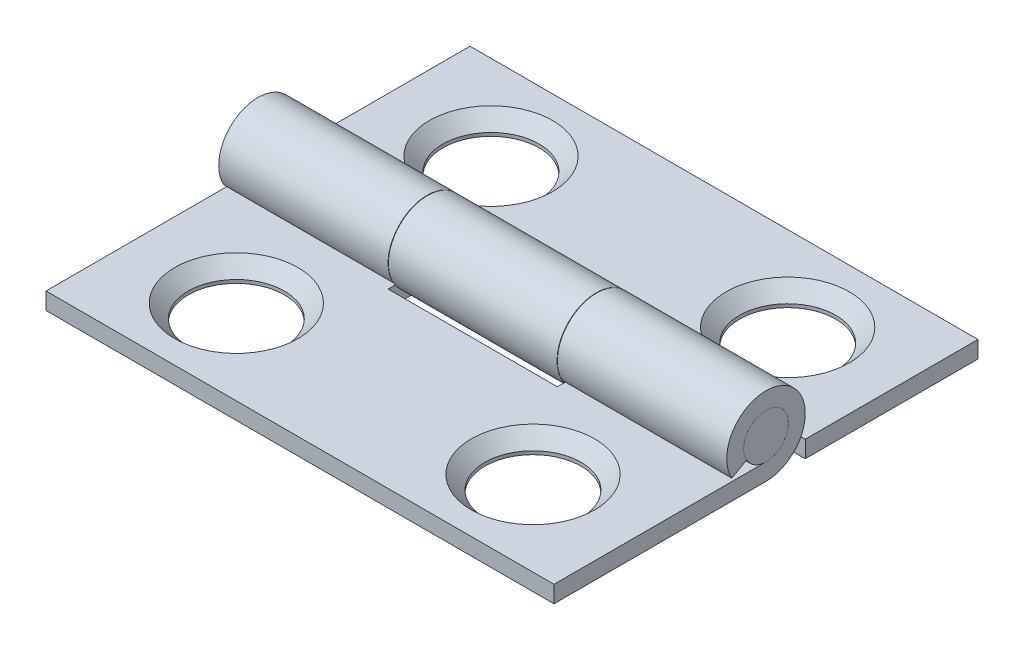
ISO-10303-21;
HEADER;
FILE_DESCRIPTION(('STEP AP214'),'2;1');
FILE_NAME('part.step','',(''),(''),'','','');
FILE_SCHEMA(('AUTOMOTIVE_DESIGN { 1 0 10303 214 1 1 1 1 }'));
ENDSEC;
DATA;
#1=APPLICATION_CONTEXT('core data for automotive mechanical design processes');
#2=APPLICATION_PROTOCOL_DEFINITION('international standard','automotive_design',2000,#1);
#3=PRODUCT_CONTEXT('',#1,'mechanical');
#4=PRODUCT('Part','Part','',(#3));
#5=PRODUCT_RELATED_PRODUCT_CATEGORY('part','',(#4));
#6=PRODUCT_DEFINITION_FORMATION('','',#4);
#7=PRODUCT_DEFINITION_CONTEXT('part definition',#1,'design');
#8=PRODUCT_DEFINITION('design','',#6,#7);
#9=PRODUCT_DEFINITION_SHAPE('','',#8);
#10=(LENGTH_UNIT() NAMED_UNIT(*) SI_UNIT(.MILLI.,.METRE.));
#11=(NAMED_UNIT(*) PLANE_ANGLE_UNIT() SI_UNIT($,.RADIAN.));
#12=(NAMED_UNIT(*) SI_UNIT($,.STERADIAN.) SOLID_ANGLE_UNIT());
#13=UNCERTAINTY_MEASURE_WITH_UNIT(LENGTH_MEASURE(1.E-05),#10,'distance_accuracy_value','');
#14=(GEOMETRIC_REPRESENTATION_CONTEXT(3) GLOBAL_UNCERTAINTY_ASSIGNED_CONTEXT((#13)) GLOBAL_UNIT_ASSIGNED_CONTEXT((#10,
#11,#12)) REPRESENTATION_CONTEXT('',''));
#15=CARTESIAN_POINT('',(0.,0.,0.));
#16=DIRECTION('',(0.,0.,1.));
#17=DIRECTION('',(1.,0.,0.));
#18=AXIS2_PLACEMENT_3D('',#15,#16,#17);
#19=CARTESIAN_POINT('',(9.525,0.,0.));
#20=DIRECTION('',(-1.,0.,0.));
#21=DIRECTION('',(0.,0.,1.));
#22=AXIS2_PLACEMENT_3D('',#19,#20,#21);
#23=CYLINDRICAL_SURFACE('',#22,0.8382);
#24=CARTESIAN_POINT('',(9.525,0.,0.));
#25=DIRECTION('',(1.,0.,0.));
#26=DIRECTION('',(0.,0.,-1.));
#27=AXIS2_PLACEMENT_3D('',#24,#25,#26);
#28=CIRCLE('',#27,0.8382);
#29=CARTESIAN_POINT('',(9.525,0.,-0.8382));
#30=VERTEX_POINT('',#29);
#31=EDGE_CURVE('E12',#30,#30,#28,.T.);
#32=ORIENTED_EDGE('',*,*,#31,.F.);
#33=EDGE_LOOP('',(#32));
#34=FACE_BOUND('',#33,.T.);
#35=CARTESIAN_POINT('',(-9.525,0.,0.));
#36=DIRECTION('',(1.,0.,0.));
#37=DIRECTION('',(0.,0.,-1.));
#38=AXIS2_PLACEMENT_3D('',#35,#36,#37);
#39=CIRCLE('',#38,0.8382);
#40=CARTESIAN_POINT('',(-9.525,0.,-0.8382));
#41=VERTEX_POINT('',#40);
#42=EDGE_CURVE('E88',#41,#41,#39,.T.);
#43=ORIENTED_EDGE('',*,*,#42,.T.);
#44=EDGE_LOOP('',(#43));
#45=FACE_BOUND('',#44,.T.);
#46=ADVANCED_FACE('F85',(#34,#45),#23,.T.);
#47=CARTESIAN_POINT('',(9.525,0.,0.));
#48=DIRECTION('',(1.,0.,0.));
#49=DIRECTION('',(0.,0.,-1.));
#50=AXIS2_PLACEMENT_3D('',#47,#48,#49);
#51=PLANE('',#50);
#52=ORIENTED_EDGE('',*,*,#31,.T.);
#53=EDGE_LOOP('',(#52));
#54=FACE_BOUND('',#53,.T.);
#55=ADVANCED_FACE('F100',(#54),#51,.T.);
#56=CARTESIAN_POINT('',(-9.525,0.,0.));
#57=DIRECTION('',(1.,0.,0.));
#58=DIRECTION('',(0.,0.,-1.));
#59=AXIS2_PLACEMENT_3D('',#56,#57,#58);
#60=PLANE('',#59);
#61=ORIENTED_EDGE('',*,*,#42,.F.);
#62=EDGE_LOOP('',(#61));
#63=FACE_BOUND('',#62,.T.);
#64=ADVANCED_FACE('F98',(#63),#60,.F.);
#65=CLOSED_SHELL('',(#46,#55,#64));
#66=MANIFOLD_SOLID_BREP('B2',#65);
#67=CARTESIAN_POINT('',(-9.525,0.,0.));
#68=DIRECTION('',(1.,0.,0.));
#69=DIRECTION('',(0.,0.,-1.));
#70=AXIS2_PLACEMENT_3D('',#67,#68,#69);
#71=CYLINDRICAL_SURFACE('',#70,1.47320000000008);
#72=DIRECTION('',(1.,0.,0.));
#73=VECTOR('',#72,1.);
#74=CARTESIAN_POINT('',(-9.525,-0.728533124002552,-1.28045215733782));
#75=LINE('',#74,#73);
#76=CARTESIAN_POINT('',(-3.1623,-0.728533124002552,-1.28045215733782));
#77=VERTEX_POINT('',#76);
#78=CARTESIAN_POINT('',(3.16230000000002,-0.728533124002552,-1.28045215733782));
#79=VERTEX_POINT('',#78);
#80=EDGE_CURVE('E283',#77,#79,#75,.T.);
#81=ORIENTED_EDGE('',*,*,#80,.F.);
#82=CARTESIAN_POINT('',(-3.1623,0.,0.));
#83=DIRECTION('',(1.,0.,0.));
#84=DIRECTION('',(0.,0.,-1.));
#85=AXIS2_PLACEMENT_3D('',#82,#83,#84);
#86=CIRCLE('',#85,1.47320000000008);
#87=CARTESIAN_POINT('',(-3.1623,-1.4732,0.));
#88=VERTEX_POINT('',#87);
#89=EDGE_CURVE('E262',#77,#88,#86,.T.);
#90=ORIENTED_EDGE('',*,*,#89,.T.);
#91=DIRECTION('',(1.,0.,0.));
#92=VECTOR('',#91,1.);
#93=CARTESIAN_POINT('',(-9.525,-1.4732,0.));
#94=LINE('',#93,#92);
#95=CARTESIAN_POINT('',(3.16230000000001,-1.4732,0.));
#96=VERTEX_POINT('',#95);
#97=EDGE_CURVE('E233',#88,#96,#94,.T.);
#98=ORIENTED_EDGE('',*,*,#97,.T.);
#99=CARTESIAN_POINT('',(3.16230000000002,0.,0.));
#100=DIRECTION('',(-1.,0.,0.));
#101=DIRECTION('',(0.,0.,1.));
#102=AXIS2_PLACEMENT_3D('',#99,#100,#101);
#103=CIRCLE('',#102,1.47320000000008);
#104=EDGE_CURVE('E254',#96,#79,#103,.T.);
#105=ORIENTED_EDGE('',*,*,#104,.T.);
#106=EDGE_LOOP('',(#81,#90,#98,#105));
#107=FACE_BOUND('',#106,.T.);
#108=ADVANCED_FACE('F134',(#107),#71,.T.);
#109=CARTESIAN_POINT('',(-9.525,0.,0.));
#110=DIRECTION('',(1.,0.,0.));
#111=DIRECTION('',(0.,0.,-1.));
#112=AXIS2_PLACEMENT_3D('',#109,#110,#111);
#113=CYLINDRICAL_SURFACE('',#112,0.8382);
#114=DIRECTION('',(1.,0.,0.));
#115=VECTOR('',#114,1.);
#116=CARTESIAN_POINT('',(-9.525,-0.8382,0.));
#117=LINE('',#116,#115);
#118=CARTESIAN_POINT('',(-3.1623,-0.8382,0.));
#119=VERTEX_POINT('',#118);
#120=CARTESIAN_POINT('',(3.16230000000002,-0.8382,0.));
#121=VERTEX_POINT('',#120);
#122=EDGE_CURVE('E293',#119,#121,#117,.T.);
#123=ORIENTED_EDGE('',*,*,#122,.F.);
#124=CARTESIAN_POINT('',(-3.1623,0.,0.));
#125=DIRECTION('',(1.,0.,0.));
#126=DIRECTION('',(0.,0.,-1.));
#127=AXIS2_PLACEMENT_3D('',#124,#125,#126);
#128=CIRCLE('',#127,0.8382);
#129=CARTESIAN_POINT('',(-3.1623,-0.41451022572559,-0.728533124002553));
#130=VERTEX_POINT('',#129);
#131=EDGE_CURVE('E261',#119,#130,#128,.F.);
#132=ORIENTED_EDGE('',*,*,#131,.T.);
#133=DIRECTION('',(1.,0.,0.));
#134=VECTOR('',#133,1.);
#135=CARTESIAN_POINT('',(-9.525,-0.41451022572559,-0.728533124002553));
#136=LINE('',#135,#134);
#137=CARTESIAN_POINT('',(3.16230000000002,-0.41451022572559,-0.728533124002553));
#138=VERTEX_POINT('',#137);
#139=EDGE_CURVE('E275',#130,#138,#136,.T.);
#140=ORIENTED_EDGE('',*,*,#139,.T.);
#141=CARTESIAN_POINT('',(3.16230000000002,0.,0.));
#142=DIRECTION('',(-1.,0.,0.));
#143=DIRECTION('',(0.,0.,1.));
#144=AXIS2_PLACEMENT_3D('',#141,#142,#143);
#145=CIRCLE('',#144,0.8382);
#146=EDGE_CURVE('E253',#138,#121,#145,.F.);
#147=ORIENTED_EDGE('',*,*,#146,.T.);
#148=EDGE_LOOP('',(#123,#132,#140,#147));
#149=FACE_BOUND('',#148,.T.);
#150=ADVANCED_FACE('F136',(#149),#113,.F.);
#151=CARTESIAN_POINT('',(-9.525,-0.838199999999995,-7.9502));
#152=DIRECTION('',(0.,-1.,0.));
#153=DIRECTION('',(0.,0.,1.));
#154=AXIS2_PLACEMENT_3D('',#151,#152,#153);
#155=PLANE('',#154);
#156=CARTESIAN_POINT('',(5.5626,-0.838199999999997,-4.7752));
#157=DIRECTION('',(0.,1.,0.));
#158=DIRECTION('',(0.,0.,1.));
#159=AXIS2_PLACEMENT_3D('',#156,#157,#158);
#160=CIRCLE('',#159,2.3114);
#161=CARTESIAN_POINT('',(5.5626,-0.838199999999998,-2.4638));
#162=VERTEX_POINT('',#161);
#163=EDGE_CURVE('E247',#162,#162,#160,.T.);
#164=ORIENTED_EDGE('',*,*,#163,.F.);
#165=EDGE_LOOP('',(#164));
#166=FACE_BOUND('',#165,.T.);
#167=CARTESIAN_POINT('',(-5.5626,-0.838199999999997,-4.7752));
#168=DIRECTION('',(0.,1.,0.));
#169=DIRECTION('',(0.,0.,1.));
#170=AXIS2_PLACEMENT_3D('',#167,#168,#169);
#171=CIRCLE('',#170,2.3114);
#172=CARTESIAN_POINT('',(-5.5626,-0.838199999999998,-2.4638));
#173=VERTEX_POINT('',#172);
#174=EDGE_CURVE('E240',#173,#173,#171,.T.);
#175=ORIENTED_EDGE('',*,*,#174,.F.);
#176=EDGE_LOOP('',(#175));
#177=FACE_BOUND('',#176,.T.);
#178=DIRECTION('',(1.,0.,0.));
#179=VECTOR('',#178,1.);
#180=CARTESIAN_POINT('',(-9.525,-0.838199999999999,-1.47320000000003));
#181=LINE('',#180,#179);
#182=CARTESIAN_POINT('',(-9.525,-0.838199999999999,-1.47320000000003));
#183=VERTEX_POINT('',#182);
#184=CARTESIAN_POINT('',(-3.1623,-0.838199999999999,-1.47320000000003));
#185=VERTEX_POINT('',#184);
#186=EDGE_CURVE('E151',#183,#185,#181,.T.);
#187=ORIENTED_EDGE('',*,*,#186,.T.);
#188=DIRECTION('',(0.,0.,1.));
#189=VECTOR('',#188,1.);
#190=CARTESIAN_POINT('',(-3.1623,-0.838199999999995,-7.9502));
#191=LINE('',#190,#189);
#192=EDGE_CURVE('E220',#185,#119,#191,.T.);
#193=ORIENTED_EDGE('',*,*,#192,.T.);
#194=ORIENTED_EDGE('',*,*,#122,.T.);
#195=DIRECTION('',(0.,0.,-1.));
#196=VECTOR('',#195,1.);
#197=CARTESIAN_POINT('',(3.16230000000002,-0.838199999999995,-7.9502));
#198=LINE('',#197,#196);
#199=CARTESIAN_POINT('',(3.16230000000001,-0.838199999999999,-1.47320000000003));
#200=VERTEX_POINT('',#199);
#201=EDGE_CURVE('E256',#121,#200,#198,.T.);
#202=ORIENTED_EDGE('',*,*,#201,.T.);
#203=DIRECTION('',(1.,0.,0.));
#204=VECTOR('',#203,1.);
#205=CARTESIAN_POINT('',(-9.525,-0.838199999999999,-1.47320000000003));
#206=LINE('',#205,#204);
#207=CARTESIAN_POINT('',(9.525,-0.838199999999998,-1.47320000000003));
#208=VERTEX_POINT('',#207);
#209=EDGE_CURVE('E243',#200,#208,#206,.T.);
#210=ORIENTED_EDGE('',*,*,#209,.T.);
#211=DIRECTION('',(0.,0.,-1.));
#212=VECTOR('',#211,1.);
#213=CARTESIAN_POINT('',(9.525,-0.838199999999995,-7.9502));
#214=LINE('',#213,#212);
#215=CARTESIAN_POINT('',(9.525,-0.838199999999995,-7.9502));
#216=VERTEX_POINT('',#215);
#217=EDGE_CURVE('E267',#208,#216,#214,.T.);
#218=ORIENTED_EDGE('',*,*,#217,.T.);
#219=DIRECTION('',(1.,0.,0.));
#220=VECTOR('',#219,1.);
#221=CARTESIAN_POINT('',(-9.525,-0.838199999999995,-7.9502));
#222=LINE('',#221,#220);
#223=CARTESIAN_POINT('',(-9.525,-0.838199999999995,-7.9502));
#224=VERTEX_POINT('',#223);
#225=EDGE_CURVE('E290',#224,#216,#222,.T.);
#226=ORIENTED_EDGE('',*,*,#225,.F.);
#227=DIRECTION('',(0.,0.,-1.));
#228=VECTOR('',#227,1.);
#229=CARTESIAN_POINT('',(-9.525,-0.838199999999995,-7.9502));
#230=LINE('',#229,#228);
#231=EDGE_CURVE('E268',#183,#224,#230,.T.);
#232=ORIENTED_EDGE('',*,*,#231,.F.);
#233=EDGE_LOOP('',(#187,#193,#194,#202,#210,#218,#226,#232));
#234=FACE_BOUND('',#233,.T.);
#235=ADVANCED_FACE('F318',(#166,#177,#234),#155,.F.);
#236=CARTESIAN_POINT('',(-9.525,-1.4732,-7.9502));
#237=DIRECTION('',(0.,0.,1.));
#238=DIRECTION('',(1.,0.,0.));
#239=AXIS2_PLACEMENT_3D('',#236,#237,#238);
#240=PLANE('',#239);
#241=DIRECTION('',(0.,-1.,0.));
#242=VECTOR('',#241,1.);
#243=CARTESIAN_POINT('',(9.525,-1.4732,-7.9502));
#244=LINE('',#243,#242);
#245=CARTESIAN_POINT('',(9.525,-1.4732,-7.9502));
#246=VERTEX_POINT('',#245);
#247=EDGE_CURVE('E277',#216,#246,#244,.T.);
#248=ORIENTED_EDGE('',*,*,#247,.T.);
#249=DIRECTION('',(1.,0.,0.));
#250=VECTOR('',#249,1.);
#251=CARTESIAN_POINT('',(-9.525,-1.4732,-7.9502));
#252=LINE('',#251,#250);
#253=CARTESIAN_POINT('',(-9.525,-1.4732,-7.9502));
#254=VERTEX_POINT('',#253);
#255=EDGE_CURVE('E287',#254,#246,#252,.T.);
#256=ORIENTED_EDGE('',*,*,#255,.F.);
#257=DIRECTION('',(0.,-1.,0.));
#258=VECTOR('',#257,1.);
#259=CARTESIAN_POINT('',(-9.525,-1.4732,-7.9502));
#260=LINE('',#259,#258);
#261=EDGE_CURVE('E270',#224,#254,#260,.T.);
#262=ORIENTED_EDGE('',*,*,#261,.F.);
#263=ORIENTED_EDGE('',*,*,#225,.T.);
#264=EDGE_LOOP('',(#248,#256,#262,#263));
#265=FACE_BOUND('',#264,.T.);
#266=ADVANCED_FACE('F321',(#265),#240,.F.);
#267=CARTESIAN_POINT('',(-9.525,-1.4732,0.));
#268=DIRECTION('',(0.,1.,0.));
#269=DIRECTION('',(0.,0.,-1.));
#270=AXIS2_PLACEMENT_3D('',#267,#268,#269);
#271=PLANE('',#270);
#272=CARTESIAN_POINT('',(-5.5626,-1.47320000000001,-4.7752));
#273=DIRECTION('',(0.,1.,0.));
#274=DIRECTION('',(0.,0.,1.));
#275=AXIS2_PLACEMENT_3D('',#272,#273,#274);
#276=CIRCLE('',#275,1.8034);
#277=CARTESIAN_POINT('',(-5.5626,-1.47320000000001,-2.9718));
#278=VERTEX_POINT('',#277);
#279=EDGE_CURVE('E299',#278,#278,#276,.T.);
#280=ORIENTED_EDGE('',*,*,#279,.T.);
#281=EDGE_LOOP('',(#280));
#282=FACE_BOUND('',#281,.T.);
#283=CARTESIAN_POINT('',(5.5626,-1.47320000000001,-4.7752));
#284=DIRECTION('',(0.,1.,0.));
#285=DIRECTION('',(0.,0.,1.));
#286=AXIS2_PLACEMENT_3D('',#283,#284,#285);
#287=CIRCLE('',#286,1.8034);
#288=CARTESIAN_POINT('',(5.5626,-1.47320000000001,-2.9718));
#289=VERTEX_POINT('',#288);
#290=EDGE_CURVE('E304',#289,#289,#287,.T.);
#291=ORIENTED_EDGE('',*,*,#290,.T.);
#292=EDGE_LOOP('',(#291));
#293=FACE_BOUND('',#292,.T.);
#294=ORIENTED_EDGE('',*,*,#97,.F.);
#295=DIRECTION('',(0.,0.,-1.));
#296=VECTOR('',#295,1.);
#297=CARTESIAN_POINT('',(-3.1623,-1.4732,-1.47320000000003));
#298=LINE('',#297,#296);
#299=CARTESIAN_POINT('',(-3.1623,-1.4732,-1.47320000000003));
#300=VERTEX_POINT('',#299);
#301=EDGE_CURVE('E217',#88,#300,#298,.T.);
#302=ORIENTED_EDGE('',*,*,#301,.T.);
#303=DIRECTION('',(-1.,0.,0.));
#304=VECTOR('',#303,1.);
#305=CARTESIAN_POINT('',(-3.1623,-1.4732,-1.47320000000003));
#306=LINE('',#305,#304);
#307=CARTESIAN_POINT('',(-9.52499999999999,-1.4732,-1.47320000000003));
#308=VERTEX_POINT('',#307);
#309=EDGE_CURVE('E222',#300,#308,#306,.T.);
#310=ORIENTED_EDGE('',*,*,#309,.T.);
#311=DIRECTION('',(0.,0.,1.));
#312=VECTOR('',#311,1.);
#313=CARTESIAN_POINT('',(-9.525,-1.4732,0.));
#314=LINE('',#313,#312);
#315=EDGE_CURVE('E273',#254,#308,#314,.T.);
#316=ORIENTED_EDGE('',*,*,#315,.F.);
#317=ORIENTED_EDGE('',*,*,#255,.T.);
#318=DIRECTION('',(0.,0.,1.));
#319=VECTOR('',#318,1.);
#320=CARTESIAN_POINT('',(9.525,-1.4732,0.));
#321=LINE('',#320,#319);
#322=CARTESIAN_POINT('',(9.525,-1.4732,-1.47320000000003));
#323=VERTEX_POINT('',#322);
#324=EDGE_CURVE('E271',#246,#323,#321,.T.);
#325=ORIENTED_EDGE('',*,*,#324,.T.);
#326=DIRECTION('',(-1.,0.,0.));
#327=VECTOR('',#326,1.);
#328=CARTESIAN_POINT('',(3.16230000000001,-1.4732,-1.47320000000003));
#329=LINE('',#328,#327);
#330=CARTESIAN_POINT('',(3.16230000000001,-1.4732,-1.47320000000003));
#331=VERTEX_POINT('',#330);
#332=EDGE_CURVE('E159',#323,#331,#329,.T.);
#333=ORIENTED_EDGE('',*,*,#332,.T.);
#334=DIRECTION('',(0.,0.,1.));
#335=VECTOR('',#334,1.);
#336=CARTESIAN_POINT('',(3.16230000000001,-1.4732,-1.47320000000003));
#337=LINE('',#336,#335);
#338=EDGE_CURVE('E245',#331,#96,#337,.T.);
#339=ORIENTED_EDGE('',*,*,#338,.T.);
#340=EDGE_LOOP('',(#294,#302,#310,#316,#317,#325,#333,#339));
#341=FACE_BOUND('',#340,.T.);
#342=ADVANCED_FACE('F230',(#282,#293,#341),#271,.F.);
#343=CARTESIAN_POINT('',(-9.525,-0.41451022572559,-0.728533124002553));
#344=DIRECTION('',(0.,0.869163832024043,-0.49452424925506));
#345=DIRECTION('',(0.,-0.49452424925506,-0.869163832024044));
#346=AXIS2_PLACEMENT_3D('',#343,#344,#345);
#347=PLANE('',#346);
#348=ORIENTED_EDGE('',*,*,#139,.F.);
#349=DIRECTION('',(0.,-0.49452424925506,-0.869163832024044));
#350=VECTOR('',#349,1.);
#351=CARTESIAN_POINT('',(-3.1623,-0.414510225725591,-0.728533124002554));
#352=LINE('',#351,#350);
#353=EDGE_CURVE('E83',#130,#77,#352,.T.);
#354=ORIENTED_EDGE('',*,*,#353,.T.);
#355=ORIENTED_EDGE('',*,*,#80,.T.);
#356=DIRECTION('',(0.,0.49452424925506,0.869163832024044));
#357=VECTOR('',#356,1.);
#358=CARTESIAN_POINT('',(3.16230000000002,-0.41451022572559,-0.728533124002553));
#359=LINE('',#358,#357);
#360=EDGE_CURVE('E143',#79,#138,#359,.T.);
#361=ORIENTED_EDGE('',*,*,#360,.T.);
#362=EDGE_LOOP('',(#348,#354,#355,#361));
#363=FACE_BOUND('',#362,.T.);
#364=ADVANCED_FACE('F344',(#363),#347,.F.);
#365=CARTESIAN_POINT('',(-9.525,0.,0.));
#366=DIRECTION('',(1.,0.,0.));
#367=DIRECTION('',(0.,0.,-1.));
#368=AXIS2_PLACEMENT_3D('',#365,#366,#367);
#369=PLANE('',#368);
#370=ORIENTED_EDGE('',*,*,#315,.T.);
#371=DIRECTION('',(0.,1.,0.));
#372=VECTOR('',#371,1.);
#373=CARTESIAN_POINT('',(-9.52499999999999,-1.4732,-1.47320000000003));
#374=LINE('',#373,#372);
#375=EDGE_CURVE('E221',#308,#183,#374,.T.);
#376=ORIENTED_EDGE('',*,*,#375,.T.);
#377=ORIENTED_EDGE('',*,*,#231,.T.);
#378=ORIENTED_EDGE('',*,*,#261,.T.);
#379=EDGE_LOOP('',(#370,#376,#377,#378));
#380=FACE_BOUND('',#379,.T.);
#381=ADVANCED_FACE('F328',(#380),#369,.F.);
#382=CARTESIAN_POINT('',(9.525,0.,0.));
#383=DIRECTION('',(1.,0.,0.));
#384=DIRECTION('',(0.,0.,-1.));
#385=AXIS2_PLACEMENT_3D('',#382,#383,#384);
#386=PLANE('',#385);
#387=DIRECTION('',(0.,1.,0.));
#388=VECTOR('',#387,1.);
#389=CARTESIAN_POINT('',(9.525,-1.4732,-1.47320000000003));
#390=LINE('',#389,#388);
#391=EDGE_CURVE('E237',#323,#208,#390,.T.);
#392=ORIENTED_EDGE('',*,*,#391,.F.);
#393=ORIENTED_EDGE('',*,*,#324,.F.);
#394=ORIENTED_EDGE('',*,*,#247,.F.);
#395=ORIENTED_EDGE('',*,*,#217,.F.);
#396=EDGE_LOOP('',(#392,#393,#394,#395));
#397=FACE_BOUND('',#396,.T.);
#398=ADVANCED_FACE('F334',(#397),#386,.T.);
#399=CARTESIAN_POINT('',(3.16230000000001,-1.4732,-1.47320000000003));
#400=DIRECTION('',(-1.,0.,0.));
#401=DIRECTION('',(0.,0.,1.));
#402=AXIS2_PLACEMENT_3D('',#399,#400,#401);
#403=PLANE('',#402);
#404=ORIENTED_EDGE('',*,*,#146,.F.);
#405=ORIENTED_EDGE('',*,*,#360,.F.);
#406=ORIENTED_EDGE('',*,*,#104,.F.);
#407=ORIENTED_EDGE('',*,*,#338,.F.);
#408=DIRECTION('',(0.,1.,0.));
#409=VECTOR('',#408,1.);
#410=CARTESIAN_POINT('',(3.16230000000001,-1.4732,-1.47320000000003));
#411=LINE('',#410,#409);
#412=EDGE_CURVE('E234',#331,#200,#411,.T.);
#413=ORIENTED_EDGE('',*,*,#412,.T.);
#414=ORIENTED_EDGE('',*,*,#201,.F.);
#415=EDGE_LOOP('',(#404,#405,#406,#407,#413,#414));
#416=FACE_BOUND('',#415,.T.);
#417=ADVANCED_FACE('F338',(#416),#403,.F.);
#418=CARTESIAN_POINT('',(3.16230000000001,-1.4732,-1.47320000000003));
#419=DIRECTION('',(0.,0.,-1.));
#420=DIRECTION('',(-1.,0.,0.));
#421=AXIS2_PLACEMENT_3D('',#418,#419,#420);
#422=PLANE('',#421);
#423=ORIENTED_EDGE('',*,*,#412,.F.);
#424=ORIENTED_EDGE('',*,*,#332,.F.);
#425=ORIENTED_EDGE('',*,*,#391,.T.);
#426=ORIENTED_EDGE('',*,*,#209,.F.);
#427=EDGE_LOOP('',(#423,#424,#425,#426));
#428=FACE_BOUND('',#427,.T.);
#429=ADVANCED_FACE('F336',(#428),#422,.F.);
#430=CARTESIAN_POINT('',(-3.1623,-1.4732,-1.47320000000003));
#431=DIRECTION('',(1.,0.,0.));
#432=DIRECTION('',(0.,0.,-1.));
#433=AXIS2_PLACEMENT_3D('',#430,#431,#432);
#434=PLANE('',#433);
#435=ORIENTED_EDGE('',*,*,#89,.F.);
#436=ORIENTED_EDGE('',*,*,#353,.F.);
#437=ORIENTED_EDGE('',*,*,#131,.F.);
#438=ORIENTED_EDGE('',*,*,#192,.F.);
#439=DIRECTION('',(0.,1.,0.));
#440=VECTOR('',#439,1.);
#441=CARTESIAN_POINT('',(-3.1623,-1.4732,-1.47320000000003));
#442=LINE('',#441,#440);
#443=EDGE_CURVE('E213',#300,#185,#442,.T.);
#444=ORIENTED_EDGE('',*,*,#443,.F.);
#445=ORIENTED_EDGE('',*,*,#301,.F.);
#446=EDGE_LOOP('',(#435,#436,#437,#438,#444,#445));
#447=FACE_BOUND('',#446,.T.);
#448=ADVANCED_FACE('F215',(#447),#434,.F.);
#449=CARTESIAN_POINT('',(-3.1623,-1.4732,-1.47320000000003));
#450=DIRECTION('',(0.,0.,-1.));
#451=DIRECTION('',(-1.,0.,0.));
#452=AXIS2_PLACEMENT_3D('',#449,#450,#451);
#453=PLANE('',#452);
#454=ORIENTED_EDGE('',*,*,#375,.F.);
#455=ORIENTED_EDGE('',*,*,#309,.F.);
#456=ORIENTED_EDGE('',*,*,#443,.T.);
#457=ORIENTED_EDGE('',*,*,#186,.F.);
#458=EDGE_LOOP('',(#454,#455,#456,#457));
#459=FACE_BOUND('',#458,.T.);
#460=ADVANCED_FACE('F225',(#459),#453,.F.);
#461=CARTESIAN_POINT('',(-5.5626,-0.838199999999997,-4.7752));
#462=DIRECTION('',(0.,1.,0.));
#463=DIRECTION('',(0.,0.,1.));
#464=AXIS2_PLACEMENT_3D('',#461,#462,#463);
#465=CONICAL_SURFACE('',#464,2.3114,0.78539816339745);
#466=CARTESIAN_POINT('',(-5.5626,-1.3462,-4.7752));
#467=DIRECTION('',(0.,1.,0.));
#468=DIRECTION('',(0.,0.,1.));
#469=AXIS2_PLACEMENT_3D('',#466,#467,#468);
#470=CIRCLE('',#469,1.8034);
#471=CARTESIAN_POINT('',(-5.5626,-1.3462,-2.9718));
#472=VERTEX_POINT('',#471);
#473=EDGE_CURVE('E138',#472,#472,#470,.F.);
#474=ORIENTED_EDGE('',*,*,#473,.T.);
#475=EDGE_LOOP('',(#474));
#476=FACE_BOUND('',#475,.T.);
#477=ORIENTED_EDGE('',*,*,#174,.T.);
#478=EDGE_LOOP('',(#477));
#479=FACE_BOUND('',#478,.T.);
#480=ADVANCED_FACE('F316',(#476,#479),#465,.F.);
#481=CARTESIAN_POINT('',(5.5626,-0.838199999999997,-4.7752));
#482=DIRECTION('',(0.,1.,0.));
#483=DIRECTION('',(0.,0.,1.));
#484=AXIS2_PLACEMENT_3D('',#481,#482,#483);
#485=CONICAL_SURFACE('',#484,2.3114,0.78539816339745);
#486=CARTESIAN_POINT('',(5.5626,-1.3462,-4.7752));
#487=DIRECTION('',(0.,1.,0.));
#488=DIRECTION('',(0.,0.,1.));
#489=AXIS2_PLACEMENT_3D('',#486,#487,#488);
#490=CIRCLE('',#489,1.8034);
#491=CARTESIAN_POINT('',(5.5626,-1.3462,-2.9718));
#492=VERTEX_POINT('',#491);
#493=EDGE_CURVE('E297',#492,#492,#490,.F.);
#494=ORIENTED_EDGE('',*,*,#493,.T.);
#495=EDGE_LOOP('',(#494));
#496=FACE_BOUND('',#495,.T.);
#497=ORIENTED_EDGE('',*,*,#163,.T.);
#498=EDGE_LOOP('',(#497));
#499=FACE_BOUND('',#498,.T.);
#500=ADVANCED_FACE('F413',(#496,#499),#485,.F.);
#501=CARTESIAN_POINT('',(5.5626,-1.47320000000001,-4.7752));
#502=DIRECTION('',(0.,1.,0.));
#503=DIRECTION('',(0.,0.,1.));
#504=AXIS2_PLACEMENT_3D('',#501,#502,#503);
#505=CYLINDRICAL_SURFACE('',#504,1.8034);
#506=ORIENTED_EDGE('',*,*,#290,.F.);
#507=EDGE_LOOP('',(#506));
#508=FACE_BOUND('',#507,.T.);
#509=ORIENTED_EDGE('',*,*,#493,.F.);
#510=EDGE_LOOP('',(#509));
#511=FACE_BOUND('',#510,.T.);
#512=ADVANCED_FACE('F421',(#508,#511),#505,.F.);
#513=CARTESIAN_POINT('',(-5.5626,-1.47320000000001,-4.7752));
#514=DIRECTION('',(0.,1.,0.));
#515=DIRECTION('',(0.,0.,1.));
#516=AXIS2_PLACEMENT_3D('',#513,#514,#515);
#517=CYLINDRICAL_SURFACE('',#516,1.8034);
#518=ORIENTED_EDGE('',*,*,#279,.F.);
#519=EDGE_LOOP('',(#518));
#520=FACE_BOUND('',#519,.T.);
#521=ORIENTED_EDGE('',*,*,#473,.F.);
#522=EDGE_LOOP('',(#521));
#523=FACE_BOUND('',#522,.T.);
#524=ADVANCED_FACE('F428',(#520,#523),#517,.F.);
#525=CLOSED_SHELL('',(#108,#150,#235,#266,#342,#364,#381,#398,#417,#429,#448,#460,#480,#500,
#512,#524));
#526=MANIFOLD_SOLID_BREP('B7',#525);
#527=CARTESIAN_POINT('',(9.525,0.,0.));
#528=DIRECTION('',(-1.,0.,0.));
#529=DIRECTION('',(0.,0.,1.));
#530=AXIS2_PLACEMENT_3D('',#527,#528,#529);
#531=CYLINDRICAL_SURFACE('',#530,0.8382);
#532=DIRECTION('',(-1.,0.,0.));
#533=VECTOR('',#532,1.);
#534=CARTESIAN_POINT('',(9.525,-0.414510225725591,0.728533124002553));
#535=LINE('',#534,#533);
#536=CARTESIAN_POINT('',(9.525,-0.414510225725591,0.728533124002553));
#537=VERTEX_POINT('',#536);
#538=CARTESIAN_POINT('',(3.175,-0.414510225725591,0.728533124002553));
#539=VERTEX_POINT('',#538);
#540=EDGE_CURVE('E605',#537,#539,#535,.T.);
#541=ORIENTED_EDGE('',*,*,#540,.T.);
#542=CARTESIAN_POINT('',(3.175,0.,0.));
#543=DIRECTION('',(1.,0.,0.));
#544=DIRECTION('',(0.,0.,-1.));
#545=AXIS2_PLACEMENT_3D('',#542,#543,#544);
#546=CIRCLE('',#545,0.8382);
#547=CARTESIAN_POINT('',(3.175,-0.8382,0.));
#548=VERTEX_POINT('',#547);
#549=EDGE_CURVE('E655',#539,#548,#546,.F.);
#550=ORIENTED_EDGE('',*,*,#549,.T.);
#551=DIRECTION('',(-1.,0.,0.));
#552=VECTOR('',#551,1.);
#553=CARTESIAN_POINT('',(9.525,-0.8382,0.));
#554=LINE('',#553,#552);
#555=CARTESIAN_POINT('',(9.525,-0.8382,0.));
#556=VERTEX_POINT('',#555);
#557=EDGE_CURVE('E615',#556,#548,#554,.T.);
#558=ORIENTED_EDGE('',*,*,#557,.F.);
#559=CARTESIAN_POINT('',(9.525,0.,0.));
#560=DIRECTION('',(-1.,0.,0.));
#561=DIRECTION('',(0.,0.,1.));
#562=AXIS2_PLACEMENT_3D('',#559,#560,#561);
#563=CIRCLE('',#562,0.8382);
#564=EDGE_CURVE('E604',#537,#556,#563,.T.);
#565=ORIENTED_EDGE('',*,*,#564,.F.);
#566=EDGE_LOOP('',(#541,#550,#558,#565));
#567=FACE_BOUND('',#566,.T.);
#568=ADVANCED_FACE('F485',(#567),#531,.F.);
#569=CARTESIAN_POINT('',(9.525,0.,0.));
#570=DIRECTION('',(-1.,0.,0.));
#571=DIRECTION('',(0.,0.,1.));
#572=AXIS2_PLACEMENT_3D('',#569,#570,#571);
#573=CYLINDRICAL_SURFACE('',#572,1.47320000000008);
#574=CARTESIAN_POINT('',(3.175,0.,0.));
#575=DIRECTION('',(1.,0.,0.));
#576=DIRECTION('',(0.,0.,-1.));
#577=AXIS2_PLACEMENT_3D('',#574,#575,#576);
#578=CIRCLE('',#577,1.47320000000008);
#579=CARTESIAN_POINT('',(3.175,-1.4732,0.));
#580=VERTEX_POINT('',#579);
#581=CARTESIAN_POINT('',(3.175,-0.728533124002552,1.28045215733782));
#582=VERTEX_POINT('',#581);
#583=EDGE_CURVE('E656',#580,#582,#578,.T.);
#584=ORIENTED_EDGE('',*,*,#583,.T.);
#585=DIRECTION('',(-1.,0.,0.));
#586=VECTOR('',#585,1.);
#587=CARTESIAN_POINT('',(9.525,-0.728533124002553,1.28045215733782));
#588=LINE('',#587,#586);
#589=CARTESIAN_POINT('',(9.525,-0.728533124002553,1.28045215733782));
#590=VERTEX_POINT('',#589);
#591=EDGE_CURVE('E584',#590,#582,#588,.T.);
#592=ORIENTED_EDGE('',*,*,#591,.F.);
#593=CARTESIAN_POINT('',(9.525,0.,0.));
#594=DIRECTION('',(1.,0.,0.));
#595=DIRECTION('',(0.,0.,1.));
#596=AXIS2_PLACEMENT_3D('',#593,#594,#595);
#597=CIRCLE('',#596,1.47320000000008);
#598=CARTESIAN_POINT('',(9.525,-1.4732,0.));
#599=VERTEX_POINT('',#598);
#600=EDGE_CURVE('E561',#599,#590,#597,.T.);
#601=ORIENTED_EDGE('',*,*,#600,.F.);
#602=DIRECTION('',(-1.,0.,0.));
#603=VECTOR('',#602,1.);
#604=CARTESIAN_POINT('',(9.525,-1.4732,0.));
#605=LINE('',#604,#603);
#606=EDGE_CURVE('E571',#599,#580,#605,.T.);
#607=ORIENTED_EDGE('',*,*,#606,.T.);
#608=EDGE_LOOP('',(#584,#592,#601,#607));
#609=FACE_BOUND('',#608,.T.);
#610=ADVANCED_FACE('F582',(#609),#573,.T.);
#611=CARTESIAN_POINT('',(9.525,-0.414510225725591,0.728533124002553));
#612=DIRECTION('',(0.,0.869163832024043,0.49452424925506));
#613=DIRECTION('',(0.,-0.49452424925506,0.869163832024043));
#614=AXIS2_PLACEMENT_3D('',#611,#612,#613);
#615=PLANE('',#614);
#616=ORIENTED_EDGE('',*,*,#591,.T.);
#617=DIRECTION('',(0.,0.49452424925506,-0.869163832024043));
#618=VECTOR('',#617,1.);
#619=CARTESIAN_POINT('',(3.175,-0.414510225725591,0.728533124002554));
#620=LINE('',#619,#618);
#621=EDGE_CURVE('E132',#582,#539,#620,.T.);
#622=ORIENTED_EDGE('',*,*,#621,.T.);
#623=ORIENTED_EDGE('',*,*,#540,.F.);
#624=DIRECTION('',(0.,0.49452424925506,-0.869163832024043));
#625=VECTOR('',#624,1.);
#626=CARTESIAN_POINT('',(9.525,-0.414510225725591,0.728533124002553));
#627=LINE('',#626,#625);
#628=EDGE_CURVE('E511',#590,#537,#627,.T.);
#629=ORIENTED_EDGE('',*,*,#628,.F.);
#630=EDGE_LOOP('',(#616,#622,#623,#629));
#631=FACE_BOUND('',#630,.T.);
#632=ADVANCED_FACE('F712',(#631),#615,.F.);
#633=CARTESIAN_POINT('',(-3.175,-0.8382,0.));
#634=VERTEX_POINT('',#633);
#635=CARTESIAN_POINT('',(-9.525,-0.8382,0.));
#636=VERTEX_POINT('',#635);
#637=EDGE_CURVE('E614',#634,#636,#554,.T.);
#638=ORIENTED_EDGE('',*,*,#637,.F.);
#639=CARTESIAN_POINT('',(-3.175,0.,0.));
#640=DIRECTION('',(-1.,0.,0.));
#641=DIRECTION('',(0.,0.,1.));
#642=AXIS2_PLACEMENT_3D('',#639,#640,#641);
#643=CIRCLE('',#642,0.8382);
#644=CARTESIAN_POINT('',(-3.175,-0.414510225725591,0.728533124002553));
#645=VERTEX_POINT('',#644);
#646=EDGE_CURVE('E647',#634,#645,#643,.F.);
#647=ORIENTED_EDGE('',*,*,#646,.T.);
#648=CARTESIAN_POINT('',(-9.525,-0.414510225725591,0.728533124002553));
#649=VERTEX_POINT('',#648);
#650=EDGE_CURVE('E539',#645,#649,#535,.T.);
#651=ORIENTED_EDGE('',*,*,#650,.T.);
#652=CARTESIAN_POINT('',(-9.525,0.,0.));
#653=DIRECTION('',(-1.,0.,0.));
#654=DIRECTION('',(0.,0.,1.));
#655=AXIS2_PLACEMENT_3D('',#652,#653,#654);
#656=CIRCLE('',#655,0.8382);
#657=EDGE_CURVE('E589',#649,#636,#656,.T.);
#658=ORIENTED_EDGE('',*,*,#657,.T.);
#659=EDGE_LOOP('',(#638,#647,#651,#658));
#660=FACE_BOUND('',#659,.T.);
#661=ADVANCED_FACE('F487',(#660),#531,.F.);
#662=CARTESIAN_POINT('',(9.525,-0.8382,7.9502));
#663=DIRECTION('',(0.,-1.,0.));
#664=DIRECTION('',(0.,0.,-1.));
#665=AXIS2_PLACEMENT_3D('',#662,#663,#664);
#666=PLANE('',#665);
#667=CARTESIAN_POINT('',(5.5626,-0.8382,4.7752));
#668=DIRECTION('',(0.,1.,0.));
#669=DIRECTION('',(0.,0.,1.));
#670=AXIS2_PLACEMENT_3D('',#667,#668,#669);
#671=CIRCLE('',#670,2.3114);
#672=CARTESIAN_POINT('',(5.5626,-0.8382,7.0866));
#673=VERTEX_POINT('',#672);
#674=EDGE_CURVE('E632',#673,#673,#671,.T.);
#675=ORIENTED_EDGE('',*,*,#674,.F.);
#676=EDGE_LOOP('',(#675));
#677=FACE_BOUND('',#676,.T.);
#678=CARTESIAN_POINT('',(-5.5626,-0.8382,4.7752));
#679=DIRECTION('',(0.,1.,0.));
#680=DIRECTION('',(0.,0.,1.));
#681=AXIS2_PLACEMENT_3D('',#678,#679,#680);
#682=CIRCLE('',#681,2.3114);
#683=CARTESIAN_POINT('',(-5.5626,-0.8382,7.0866));
#684=VERTEX_POINT('',#683);
#685=EDGE_CURVE('E623',#684,#684,#682,.T.);
#686=ORIENTED_EDGE('',*,*,#685,.F.);
#687=EDGE_LOOP('',(#686));
#688=FACE_BOUND('',#687,.T.);
#689=ORIENTED_EDGE('',*,*,#557,.T.);
#690=DIRECTION('',(0.,0.,1.));
#691=VECTOR('',#690,1.);
#692=CARTESIAN_POINT('',(3.175,-0.8382,7.9502));
#693=LINE('',#692,#691);
#694=CARTESIAN_POINT('',(3.175,-0.8382,1.47320000000012));
#695=VERTEX_POINT('',#694);
#696=EDGE_CURVE('E658',#548,#695,#693,.T.);
#697=ORIENTED_EDGE('',*,*,#696,.T.);
#698=DIRECTION('',(-1.,0.,0.));
#699=VECTOR('',#698,1.);
#700=CARTESIAN_POINT('',(9.525,-0.8382,1.47320000000012));
#701=LINE('',#700,#699);
#702=CARTESIAN_POINT('',(-3.175,-0.8382,1.47320000000012));
#703=VERTEX_POINT('',#702);
#704=EDGE_CURVE('E592',#695,#703,#701,.T.);
#705=ORIENTED_EDGE('',*,*,#704,.T.);
#706=DIRECTION('',(0.,0.,-1.));
#707=VECTOR('',#706,1.);
#708=CARTESIAN_POINT('',(-3.175,-0.8382,7.9502));
#709=LINE('',#708,#707);
#710=EDGE_CURVE('E651',#703,#634,#709,.T.);
#711=ORIENTED_EDGE('',*,*,#710,.T.);
#712=ORIENTED_EDGE('',*,*,#637,.T.);
#713=DIRECTION('',(0.,0.,1.));
#714=VECTOR('',#713,1.);
#715=CARTESIAN_POINT('',(-9.525,-0.8382,7.9502));
#716=LINE('',#715,#714);
#717=CARTESIAN_POINT('',(-9.525,-0.8382,7.9502));
#718=VERTEX_POINT('',#717);
#719=EDGE_CURVE('E591',#636,#718,#716,.T.);
#720=ORIENTED_EDGE('',*,*,#719,.T.);
#721=DIRECTION('',(-1.,0.,0.));
#722=VECTOR('',#721,1.);
#723=CARTESIAN_POINT('',(9.525,-0.8382,7.9502));
#724=LINE('',#723,#722);
#725=CARTESIAN_POINT('',(9.525,-0.8382,7.9502));
#726=VERTEX_POINT('',#725);
#727=EDGE_CURVE('E611',#726,#718,#724,.T.);
#728=ORIENTED_EDGE('',*,*,#727,.F.);
#729=DIRECTION('',(0.,0.,1.));
#730=VECTOR('',#729,1.);
#731=CARTESIAN_POINT('',(9.525,-0.8382,7.9502));
#732=LINE('',#731,#730);
#733=EDGE_CURVE('E548',#556,#726,#732,.T.);
#734=ORIENTED_EDGE('',*,*,#733,.F.);
#735=EDGE_LOOP('',(#689,#697,#705,#711,#712,#720,#728,#734));
#736=FACE_BOUND('',#735,.T.);
#737=ADVANCED_FACE('F668',(#677,#688,#736),#666,.F.);
#738=CARTESIAN_POINT('',(9.525,-1.4732,7.9502));
#739=DIRECTION('',(0.,0.,-1.));
#740=DIRECTION('',(-1.,0.,0.));
#741=AXIS2_PLACEMENT_3D('',#738,#739,#740);
#742=PLANE('',#741);
#743=DIRECTION('',(0.,-1.,0.));
#744=VECTOR('',#743,1.);
#745=CARTESIAN_POINT('',(-9.525,-1.4732,7.9502));
#746=LINE('',#745,#744);
#747=CARTESIAN_POINT('',(-9.525,-1.4732,7.9502));
#748=VERTEX_POINT('',#747);
#749=EDGE_CURVE('E594',#718,#748,#746,.T.);
#750=ORIENTED_EDGE('',*,*,#749,.T.);
#751=DIRECTION('',(-1.,0.,0.));
#752=VECTOR('',#751,1.);
#753=CARTESIAN_POINT('',(9.525,-1.4732,7.9502));
#754=LINE('',#753,#752);
#755=CARTESIAN_POINT('',(9.525,-1.4732,7.9502));
#756=VERTEX_POINT('',#755);
#757=EDGE_CURVE('E579',#756,#748,#754,.T.);
#758=ORIENTED_EDGE('',*,*,#757,.F.);
#759=DIRECTION('',(0.,-1.,0.));
#760=VECTOR('',#759,1.);
#761=CARTESIAN_POINT('',(9.525,-1.4732,7.9502));
#762=LINE('',#761,#760);
#763=EDGE_CURVE('E564',#726,#756,#762,.T.);
#764=ORIENTED_EDGE('',*,*,#763,.F.);
#765=ORIENTED_EDGE('',*,*,#727,.T.);
#766=EDGE_LOOP('',(#750,#758,#764,#765));
#767=FACE_BOUND('',#766,.T.);
#768=ADVANCED_FACE('F672',(#767),#742,.F.);
#769=CARTESIAN_POINT('',(9.525,-1.4732,0.));
#770=DIRECTION('',(0.,1.,0.));
#771=DIRECTION('',(0.,0.,1.));
#772=AXIS2_PLACEMENT_3D('',#769,#770,#771);
#773=PLANE('',#772);
#774=CARTESIAN_POINT('',(5.5626,-1.4732,4.7752));
#775=DIRECTION('',(0.,1.,0.));
#776=DIRECTION('',(0.,0.,1.));
#777=AXIS2_PLACEMENT_3D('',#774,#775,#776);
#778=CIRCLE('',#777,1.8034);
#779=CARTESIAN_POINT('',(5.5626,-1.4732,6.5786));
#780=VERTEX_POINT('',#779);
#781=EDGE_CURVE('E619',#780,#780,#778,.T.);
#782=ORIENTED_EDGE('',*,*,#781,.T.);
#783=EDGE_LOOP('',(#782));
#784=FACE_BOUND('',#783,.T.);
#785=CARTESIAN_POINT('',(-5.5626,-1.4732,4.7752));
#786=DIRECTION('',(0.,1.,0.));
#787=DIRECTION('',(0.,0.,1.));
#788=AXIS2_PLACEMENT_3D('',#785,#786,#787);
#789=CIRCLE('',#788,1.8034);
#790=CARTESIAN_POINT('',(-5.5626,-1.4732,6.5786));
#791=VERTEX_POINT('',#790);
#792=EDGE_CURVE('E625',#791,#791,#789,.T.);
#793=ORIENTED_EDGE('',*,*,#792,.T.);
#794=EDGE_LOOP('',(#793));
#795=FACE_BOUND('',#794,.T.);
#796=DIRECTION('',(1.,0.,0.));
#797=VECTOR('',#796,1.);
#798=CARTESIAN_POINT('',(3.175,-1.4732,1.47320000000012));
#799=LINE('',#798,#797);
#800=CARTESIAN_POINT('',(-3.175,-1.4732,1.47320000000012));
#801=VERTEX_POINT('',#800);
#802=CARTESIAN_POINT('',(3.175,-1.4732,1.47320000000012));
#803=VERTEX_POINT('',#802);
#804=EDGE_CURVE('E641',#801,#803,#799,.T.);
#805=ORIENTED_EDGE('',*,*,#804,.T.);
#806=DIRECTION('',(0.,0.,-1.));
#807=VECTOR('',#806,1.);
#808=CARTESIAN_POINT('',(3.175,-1.4732,-1.47320000000013));
#809=LINE('',#808,#807);
#810=EDGE_CURVE('E576',#803,#580,#809,.T.);
#811=ORIENTED_EDGE('',*,*,#810,.T.);
#812=ORIENTED_EDGE('',*,*,#606,.F.);
#813=DIRECTION('',(0.,0.,-1.));
#814=VECTOR('',#813,1.);
#815=CARTESIAN_POINT('',(9.525,-1.4732,0.));
#816=LINE('',#815,#814);
#817=EDGE_CURVE('E557',#756,#599,#816,.T.);
#818=ORIENTED_EDGE('',*,*,#817,.F.);
#819=ORIENTED_EDGE('',*,*,#757,.T.);
#820=DIRECTION('',(0.,0.,-1.));
#821=VECTOR('',#820,1.);
#822=CARTESIAN_POINT('',(-9.525,-1.4732,0.));
#823=LINE('',#822,#821);
#824=CARTESIAN_POINT('',(-9.525,-1.4732,0.));
#825=VERTEX_POINT('',#824);
#826=EDGE_CURVE('E596',#748,#825,#823,.T.);
#827=ORIENTED_EDGE('',*,*,#826,.T.);
#828=CARTESIAN_POINT('',(-3.175,-1.4732,0.));
#829=VERTEX_POINT('',#828);
#830=EDGE_CURVE('E580',#829,#825,#605,.T.);
#831=ORIENTED_EDGE('',*,*,#830,.F.);
#832=DIRECTION('',(0.,0.,1.));
#833=VECTOR('',#832,1.);
#834=CARTESIAN_POINT('',(-3.175,-1.4732,1.47320000000012));
#835=LINE('',#834,#833);
#836=EDGE_CURVE('E638',#829,#801,#835,.T.);
#837=ORIENTED_EDGE('',*,*,#836,.T.);
#838=EDGE_LOOP('',(#805,#811,#812,#818,#819,#827,#831,#837));
#839=FACE_BOUND('',#838,.T.);
#840=ADVANCED_FACE('F573',(#784,#795,#839),#773,.F.);
#841=CARTESIAN_POINT('',(-3.175,-0.728533124002553,1.28045215733782));
#842=VERTEX_POINT('',#841);
#843=CARTESIAN_POINT('',(-9.525,-0.728533124002553,1.28045215733782));
#844=VERTEX_POINT('',#843);
#845=EDGE_CURVE('E608',#842,#844,#588,.T.);
#846=ORIENTED_EDGE('',*,*,#845,.F.);
#847=CARTESIAN_POINT('',(-3.175,0.,0.));
#848=DIRECTION('',(-1.,0.,0.));
#849=DIRECTION('',(0.,0.,1.));
#850=AXIS2_PLACEMENT_3D('',#847,#848,#849);
#851=CIRCLE('',#850,1.47320000000008);
#852=EDGE_CURVE('E502',#842,#829,#851,.T.);
#853=ORIENTED_EDGE('',*,*,#852,.T.);
#854=ORIENTED_EDGE('',*,*,#830,.T.);
#855=CARTESIAN_POINT('',(-9.525,0.,0.));
#856=DIRECTION('',(1.,0.,0.));
#857=DIRECTION('',(0.,0.,1.));
#858=AXIS2_PLACEMENT_3D('',#855,#856,#857);
#859=CIRCLE('',#858,1.47320000000008);
#860=EDGE_CURVE('E599',#825,#844,#859,.T.);
#861=ORIENTED_EDGE('',*,*,#860,.T.);
#862=EDGE_LOOP('',(#846,#853,#854,#861));
#863=FACE_BOUND('',#862,.T.);
#864=ADVANCED_FACE('F682',(#863),#573,.T.);
#865=ORIENTED_EDGE('',*,*,#650,.F.);
#866=DIRECTION('',(0.,-0.49452424925506,0.869163832024043));
#867=VECTOR('',#866,1.);
#868=CARTESIAN_POINT('',(-3.175,-0.414510225725592,0.728533124002554));
#869=LINE('',#868,#867);
#870=EDGE_CURVE('E494',#645,#842,#869,.T.);
#871=ORIENTED_EDGE('',*,*,#870,.T.);
#872=ORIENTED_EDGE('',*,*,#845,.T.);
#873=DIRECTION('',(0.,0.49452424925506,-0.869163832024043));
#874=VECTOR('',#873,1.);
#875=CARTESIAN_POINT('',(-9.525,-0.414510225725591,0.728533124002553));
#876=LINE('',#875,#874);
#877=EDGE_CURVE('E602',#844,#649,#876,.T.);
#878=ORIENTED_EDGE('',*,*,#877,.T.);
#879=EDGE_LOOP('',(#865,#871,#872,#878));
#880=FACE_BOUND('',#879,.T.);
#881=ADVANCED_FACE('F721',(#880),#615,.F.);
#882=CARTESIAN_POINT('',(9.525,0.,0.));
#883=DIRECTION('',(-1.,0.,0.));
#884=DIRECTION('',(0.,0.,1.));
#885=AXIS2_PLACEMENT_3D('',#882,#883,#884);
#886=PLANE('',#885);
#887=ORIENTED_EDGE('',*,*,#564,.T.);
#888=ORIENTED_EDGE('',*,*,#733,.T.);
#889=ORIENTED_EDGE('',*,*,#763,.T.);
#890=ORIENTED_EDGE('',*,*,#817,.T.);
#891=ORIENTED_EDGE('',*,*,#600,.T.);
#892=ORIENTED_EDGE('',*,*,#628,.T.);
#893=EDGE_LOOP('',(#887,#888,#889,#890,#891,#892));
#894=FACE_BOUND('',#893,.T.);
#895=ADVANCED_FACE('F559',(#894),#886,.F.);
#896=CARTESIAN_POINT('',(-9.525,0.,0.));
#897=DIRECTION('',(-1.,0.,0.));
#898=DIRECTION('',(0.,0.,1.));
#899=AXIS2_PLACEMENT_3D('',#896,#897,#898);
#900=PLANE('',#899);
#901=ORIENTED_EDGE('',*,*,#657,.F.);
#902=ORIENTED_EDGE('',*,*,#877,.F.);
#903=ORIENTED_EDGE('',*,*,#860,.F.);
#904=ORIENTED_EDGE('',*,*,#826,.F.);
#905=ORIENTED_EDGE('',*,*,#749,.F.);
#906=ORIENTED_EDGE('',*,*,#719,.F.);
#907=EDGE_LOOP('',(#901,#902,#903,#904,#905,#906));
#908=FACE_BOUND('',#907,.T.);
#909=ADVANCED_FACE('F678',(#908),#900,.T.);
#910=CARTESIAN_POINT('',(3.175,-1.4732,1.47320000000012));
#911=DIRECTION('',(0.,0.,1.));
#912=DIRECTION('',(1.,0.,0.));
#913=AXIS2_PLACEMENT_3D('',#910,#911,#912);
#914=PLANE('',#913);
#915=DIRECTION('',(0.,1.,0.));
#916=VECTOR('',#915,1.);
#917=CARTESIAN_POINT('',(3.175,-1.4732,1.47320000000012));
#918=LINE('',#917,#916);
#919=EDGE_CURVE('E644',#803,#695,#918,.T.);
#920=ORIENTED_EDGE('',*,*,#919,.F.);
#921=ORIENTED_EDGE('',*,*,#804,.F.);
#922=DIRECTION('',(0.,1.,0.));
#923=VECTOR('',#922,1.);
#924=CARTESIAN_POINT('',(-3.175,-1.4732,1.47320000000012));
#925=LINE('',#924,#923);
#926=EDGE_CURVE('E643',#801,#703,#925,.T.);
#927=ORIENTED_EDGE('',*,*,#926,.T.);
#928=ORIENTED_EDGE('',*,*,#704,.F.);
#929=EDGE_LOOP('',(#920,#921,#927,#928));
#930=FACE_BOUND('',#929,.T.);
#931=ADVANCED_FACE('F715',(#930),#914,.F.);
#932=CARTESIAN_POINT('',(3.175,-1.4732,-1.47320000000013));
#933=DIRECTION('',(1.,0.,0.));
#934=DIRECTION('',(0.,0.,-1.));
#935=AXIS2_PLACEMENT_3D('',#932,#933,#934);
#936=PLANE('',#935);
#937=ORIENTED_EDGE('',*,*,#549,.F.);
#938=ORIENTED_EDGE('',*,*,#621,.F.);
#939=ORIENTED_EDGE('',*,*,#583,.F.);
#940=ORIENTED_EDGE('',*,*,#810,.F.);
#941=ORIENTED_EDGE('',*,*,#919,.T.);
#942=ORIENTED_EDGE('',*,*,#696,.F.);
#943=EDGE_LOOP('',(#937,#938,#939,#940,#941,#942));
#944=FACE_BOUND('',#943,.T.);
#945=ADVANCED_FACE('F708',(#944),#936,.F.);
#946=CARTESIAN_POINT('',(-3.175,-1.4732,1.47320000000012));
#947=DIRECTION('',(-1.,0.,0.));
#948=DIRECTION('',(0.,0.,1.));
#949=AXIS2_PLACEMENT_3D('',#946,#947,#948);
#950=PLANE('',#949);
#951=ORIENTED_EDGE('',*,*,#852,.F.);
#952=ORIENTED_EDGE('',*,*,#870,.F.);
#953=ORIENTED_EDGE('',*,*,#646,.F.);
#954=ORIENTED_EDGE('',*,*,#710,.F.);
#955=ORIENTED_EDGE('',*,*,#926,.F.);
#956=ORIENTED_EDGE('',*,*,#836,.F.);
#957=EDGE_LOOP('',(#951,#952,#953,#954,#955,#956));
#958=FACE_BOUND('',#957,.T.);
#959=ADVANCED_FACE('F718',(#958),#950,.F.);
#960=CARTESIAN_POINT('',(-5.5626,-0.8382,4.7752));
#961=DIRECTION('',(0.,1.,0.));
#962=DIRECTION('',(0.,0.,1.));
#963=AXIS2_PLACEMENT_3D('',#960,#961,#962);
#964=CONICAL_SURFACE('',#963,2.3114,0.78539816339745);
#965=CARTESIAN_POINT('',(-5.5626,-1.3462,4.7752));
#966=DIRECTION('',(0.,1.,0.));
#967=DIRECTION('',(0.,0.,1.));
#968=AXIS2_PLACEMENT_3D('',#965,#966,#967);
#969=CIRCLE('',#968,1.8034);
#970=CARTESIAN_POINT('',(-5.5626,-1.3462,6.5786));
#971=VERTEX_POINT('',#970);
#972=EDGE_CURVE('E489',#971,#971,#969,.F.);
#973=ORIENTED_EDGE('',*,*,#972,.T.);
#974=EDGE_LOOP('',(#973));
#975=FACE_BOUND('',#974,.T.);
#976=ORIENTED_EDGE('',*,*,#685,.T.);
#977=EDGE_LOOP('',(#976));
#978=FACE_BOUND('',#977,.T.);
#979=ADVANCED_FACE('F761',(#975,#978),#964,.F.);
#980=CARTESIAN_POINT('',(5.5626,-0.8382,4.7752));
#981=DIRECTION('',(0.,1.,0.));
#982=DIRECTION('',(0.,0.,1.));
#983=AXIS2_PLACEMENT_3D('',#980,#981,#982);
#984=CONICAL_SURFACE('',#983,2.3114,0.78539816339745);
#985=CARTESIAN_POINT('',(5.5626,-1.3462,4.7752));
#986=DIRECTION('',(0.,1.,0.));
#987=DIRECTION('',(0.,0.,1.));
#988=AXIS2_PLACEMENT_3D('',#985,#986,#987);
#989=CIRCLE('',#988,1.8034);
#990=CARTESIAN_POINT('',(5.5626,-1.3462,6.5786));
#991=VERTEX_POINT('',#990);
#992=EDGE_CURVE('E617',#991,#991,#989,.F.);
#993=ORIENTED_EDGE('',*,*,#992,.T.);
#994=EDGE_LOOP('',(#993));
#995=FACE_BOUND('',#994,.T.);
#996=ORIENTED_EDGE('',*,*,#674,.T.);
#997=EDGE_LOOP('',(#996));
#998=FACE_BOUND('',#997,.T.);
#999=ADVANCED_FACE('F764',(#995,#998),#984,.F.);
#1000=CARTESIAN_POINT('',(5.5626,-1.4732,4.7752));
#1001=DIRECTION('',(0.,1.,0.));
#1002=DIRECTION('',(0.,0.,1.));
#1003=AXIS2_PLACEMENT_3D('',#1000,#1001,#1002);
#1004=CYLINDRICAL_SURFACE('',#1003,1.8034);
#1005=ORIENTED_EDGE('',*,*,#781,.F.);
#1006=EDGE_LOOP('',(#1005));
#1007=FACE_BOUND('',#1006,.T.);
#1008=ORIENTED_EDGE('',*,*,#992,.F.);
#1009=EDGE_LOOP('',(#1008));
#1010=FACE_BOUND('',#1009,.T.);
#1011=ADVANCED_FACE('F757',(#1007,#1010),#1004,.F.);
#1012=CARTESIAN_POINT('',(-5.5626,-1.4732,4.7752));
#1013=DIRECTION('',(0.,1.,0.));
#1014=DIRECTION('',(0.,0.,1.));
#1015=AXIS2_PLACEMENT_3D('',#1012,#1013,#1014);
#1016=CYLINDRICAL_SURFACE('',#1015,1.8034);
#1017=ORIENTED_EDGE('',*,*,#792,.F.);
#1018=EDGE_LOOP('',(#1017));
#1019=FACE_BOUND('',#1018,.T.);
#1020=ORIENTED_EDGE('',*,*,#972,.F.);
#1021=EDGE_LOOP('',(#1020));
#1022=FACE_BOUND('',#1021,.T.);
#1023=ADVANCED_FACE('F754',(#1019,#1022),#1016,.F.);
#1024=CLOSED_SHELL('',(#568,#610,#632,#661,#737,#768,#840,#864,#881,#895,#909,#931,#945,#959,
#979,#999,#1011,#1023));
#1025=MANIFOLD_SOLID_BREP('B77',#1024);
#1026=ADVANCED_BREP_SHAPE_REPRESENTATION('',(#18,#66,#526,#1025),#14);
#1027=SHAPE_DEFINITION_REPRESENTATION(#9,#1026);
ENDSEC;
END-ISO-10303-21;
